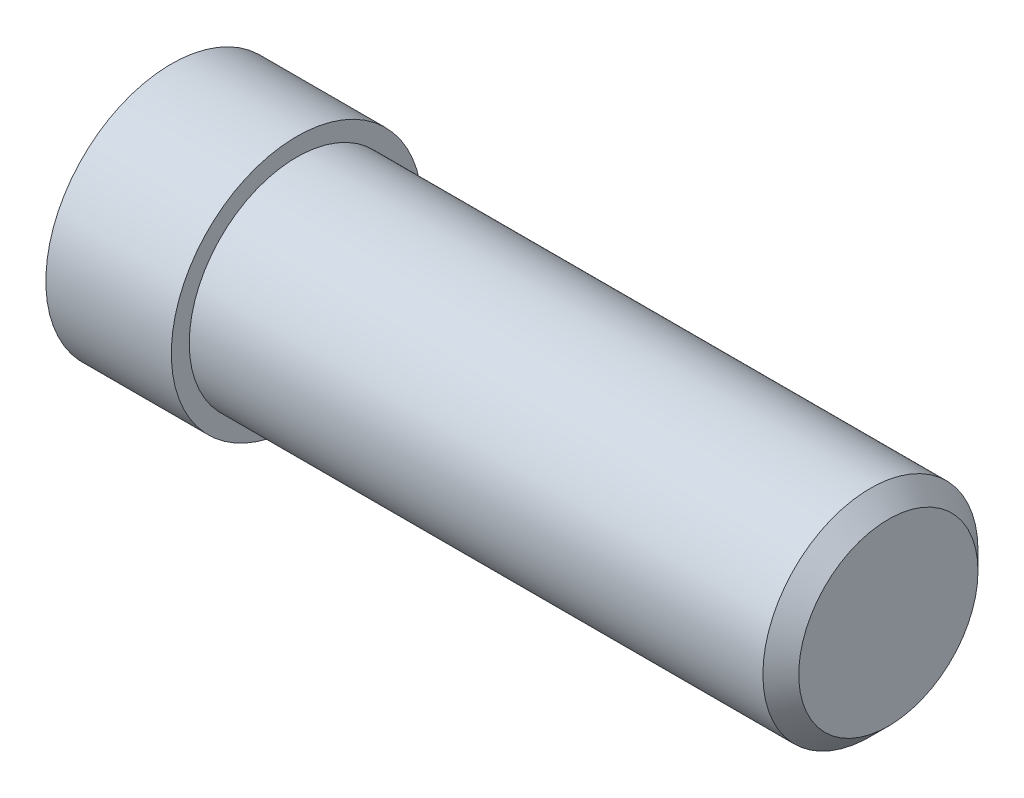
ISO-10303-21;
HEADER;
FILE_DESCRIPTION(('STEP AP214'),'2;1');
FILE_NAME('part.step','',(''),(''),'','','');
FILE_SCHEMA(('AUTOMOTIVE_DESIGN { 1 0 10303 214 1 1 1 1 }'));
ENDSEC;
DATA;
#1=APPLICATION_CONTEXT('core data for automotive mechanical design processes');
#2=APPLICATION_PROTOCOL_DEFINITION('international standard','automotive_design',2000,#1);
#3=PRODUCT_CONTEXT('',#1,'mechanical');
#4=PRODUCT('Part','Part','',(#3));
#5=PRODUCT_RELATED_PRODUCT_CATEGORY('part','',(#4));
#6=PRODUCT_DEFINITION_FORMATION('','',#4);
#7=PRODUCT_DEFINITION_CONTEXT('part definition',#1,'design');
#8=PRODUCT_DEFINITION('design','',#6,#7);
#9=PRODUCT_DEFINITION_SHAPE('','',#8);
#10=(LENGTH_UNIT() NAMED_UNIT(*) SI_UNIT(.MILLI.,.METRE.));
#11=(NAMED_UNIT(*) PLANE_ANGLE_UNIT() SI_UNIT($,.RADIAN.));
#12=(NAMED_UNIT(*) SI_UNIT($,.STERADIAN.) SOLID_ANGLE_UNIT());
#13=UNCERTAINTY_MEASURE_WITH_UNIT(LENGTH_MEASURE(1.E-05),#10,'distance_accuracy_value','');
#14=(GEOMETRIC_REPRESENTATION_CONTEXT(3) GLOBAL_UNCERTAINTY_ASSIGNED_CONTEXT((#13)) GLOBAL_UNIT_ASSIGNED_CONTEXT((#10,
#11,#12)) REPRESENTATION_CONTEXT('',''));
#15=CARTESIAN_POINT('',(0.,0.,0.));
#16=DIRECTION('',(0.,0.,1.));
#17=DIRECTION('',(1.,0.,0.));
#18=AXIS2_PLACEMENT_3D('',#15,#16,#17);
#19=CARTESIAN_POINT('',(0.,0.,0.));
#20=DIRECTION('',(-1.,0.,0.));
#21=DIRECTION('',(0.,0.,1.));
#22=AXIS2_PLACEMENT_3D('',#19,#20,#21);
#23=PLANE('',#22);
#24=CARTESIAN_POINT('',(0.,0.,0.));
#25=DIRECTION('',(1.,0.,0.));
#26=DIRECTION('',(0.,0.,-1.));
#27=AXIS2_PLACEMENT_3D('',#24,#25,#26);
#28=CIRCLE('',#27,7.);
#29=CARTESIAN_POINT('',(0.,0.,-7.));
#30=VERTEX_POINT('',#29);
#31=EDGE_CURVE('E57',#30,#30,#28,.T.);
#32=ORIENTED_EDGE('',*,*,#31,.F.);
#33=EDGE_LOOP('',(#32));
#34=FACE_BOUND('',#33,.T.);
#35=ADVANCED_FACE('F43',(#34),#23,.T.);
#36=CARTESIAN_POINT('',(49.5593025413155,0.,0.));
#37=DIRECTION('',(1.,0.,0.));
#38=DIRECTION('',(0.,0.,-1.));
#39=AXIS2_PLACEMENT_3D('',#36,#37,#38);
#40=CYLINDRICAL_SURFACE('',#39,7.);
#41=ORIENTED_EDGE('',*,*,#31,.T.);
#42=EDGE_LOOP('',(#41));
#43=FACE_BOUND('',#42,.T.);
#44=CARTESIAN_POINT('',(7.,0.,0.));
#45=DIRECTION('',(1.,0.,0.));
#46=DIRECTION('',(0.,0.,-1.));
#47=AXIS2_PLACEMENT_3D('',#44,#45,#46);
#48=CIRCLE('',#47,7.);
#49=CARTESIAN_POINT('',(7.,0.,-7.));
#50=VERTEX_POINT('',#49);
#51=EDGE_CURVE('E62',#50,#50,#48,.T.);
#52=ORIENTED_EDGE('',*,*,#51,.F.);
#53=EDGE_LOOP('',(#52));
#54=FACE_BOUND('',#53,.T.);
#55=ADVANCED_FACE('F77',(#43,#54),#40,.T.);
#56=CARTESIAN_POINT('',(7.,7.,0.));
#57=DIRECTION('',(1.,0.,0.));
#58=DIRECTION('',(0.,0.,-1.));
#59=AXIS2_PLACEMENT_3D('',#56,#57,#58);
#60=PLANE('',#59);
#61=ORIENTED_EDGE('',*,*,#51,.T.);
#62=EDGE_LOOP('',(#61));
#63=FACE_BOUND('',#62,.T.);
#64=CARTESIAN_POINT('',(7.,0.,0.));
#65=DIRECTION('',(1.,0.,0.));
#66=DIRECTION('',(0.,0.,-1.));
#67=AXIS2_PLACEMENT_3D('',#64,#65,#66);
#68=CIRCLE('',#67,6.);
#69=CARTESIAN_POINT('',(7.,0.,-6.));
#70=VERTEX_POINT('',#69);
#71=EDGE_CURVE('E68',#70,#70,#68,.T.);
#72=ORIENTED_EDGE('',*,*,#71,.F.);
#73=EDGE_LOOP('',(#72));
#74=FACE_BOUND('',#73,.T.);
#75=ADVANCED_FACE('F75',(#63,#74),#60,.T.);
#76=CARTESIAN_POINT('',(49.5593025413155,0.,0.));
#77=DIRECTION('',(1.,0.,0.));
#78=DIRECTION('',(0.,0.,-1.));
#79=AXIS2_PLACEMENT_3D('',#76,#77,#78);
#80=CYLINDRICAL_SURFACE('',#79,6.);
#81=CARTESIAN_POINT('',(39.,0.,0.));
#82=DIRECTION('',(1.,0.,0.));
#83=DIRECTION('',(0.,0.,-1.));
#84=AXIS2_PLACEMENT_3D('',#81,#82,#83);
#85=CIRCLE('',#84,6.);
#86=CARTESIAN_POINT('',(39.,0.,-6.));
#87=VERTEX_POINT('',#86);
#88=EDGE_CURVE('E10',#87,#87,#85,.F.);
#89=ORIENTED_EDGE('',*,*,#88,.T.);
#90=EDGE_LOOP('',(#89));
#91=FACE_BOUND('',#90,.T.);
#92=ORIENTED_EDGE('',*,*,#71,.T.);
#93=EDGE_LOOP('',(#92));
#94=FACE_BOUND('',#93,.T.);
#95=ADVANCED_FACE('F73',(#91,#94),#80,.T.);
#96=CARTESIAN_POINT('',(40.,6.,0.));
#97=DIRECTION('',(1.,0.,0.));
#98=DIRECTION('',(0.,0.,-1.));
#99=AXIS2_PLACEMENT_3D('',#96,#97,#98);
#100=PLANE('',#99);
#101=CARTESIAN_POINT('',(40.,0.,0.));
#102=DIRECTION('',(1.,0.,0.));
#103=DIRECTION('',(0.,0.,-1.));
#104=AXIS2_PLACEMENT_3D('',#101,#102,#103);
#105=CIRCLE('',#104,4.99999999999999);
#106=CARTESIAN_POINT('',(40.,0.,-4.99999999999999));
#107=VERTEX_POINT('',#106);
#108=EDGE_CURVE('E52',#107,#107,#105,.T.);
#109=ORIENTED_EDGE('',*,*,#108,.T.);
#110=EDGE_LOOP('',(#109));
#111=FACE_BOUND('',#110,.T.);
#112=ADVANCED_FACE('F84',(#111),#100,.T.);
#113=CARTESIAN_POINT('',(40.,0.,0.));
#114=DIRECTION('',(-1.,0.,0.));
#115=DIRECTION('',(0.,0.,1.));
#116=AXIS2_PLACEMENT_3D('',#113,#114,#115);
#117=CONICAL_SURFACE('',#116,4.99999999999999,0.785398163397445);
#118=ORIENTED_EDGE('',*,*,#88,.F.);
#119=EDGE_LOOP('',(#118));
#120=FACE_BOUND('',#119,.T.);
#121=ORIENTED_EDGE('',*,*,#108,.F.);
#122=EDGE_LOOP('',(#121));
#123=FACE_BOUND('',#122,.T.);
#124=ADVANCED_FACE('F46',(#120,#123),#117,.T.);
#125=CLOSED_SHELL('',(#35,#55,#75,#95,#112,#124));
#126=MANIFOLD_SOLID_BREP('B2',#125);
#127=ADVANCED_BREP_SHAPE_REPRESENTATION('',(#18,#126),#14);
#128=SHAPE_DEFINITION_REPRESENTATION(#9,#127);
ENDSEC;
END-ISO-10303-21;
